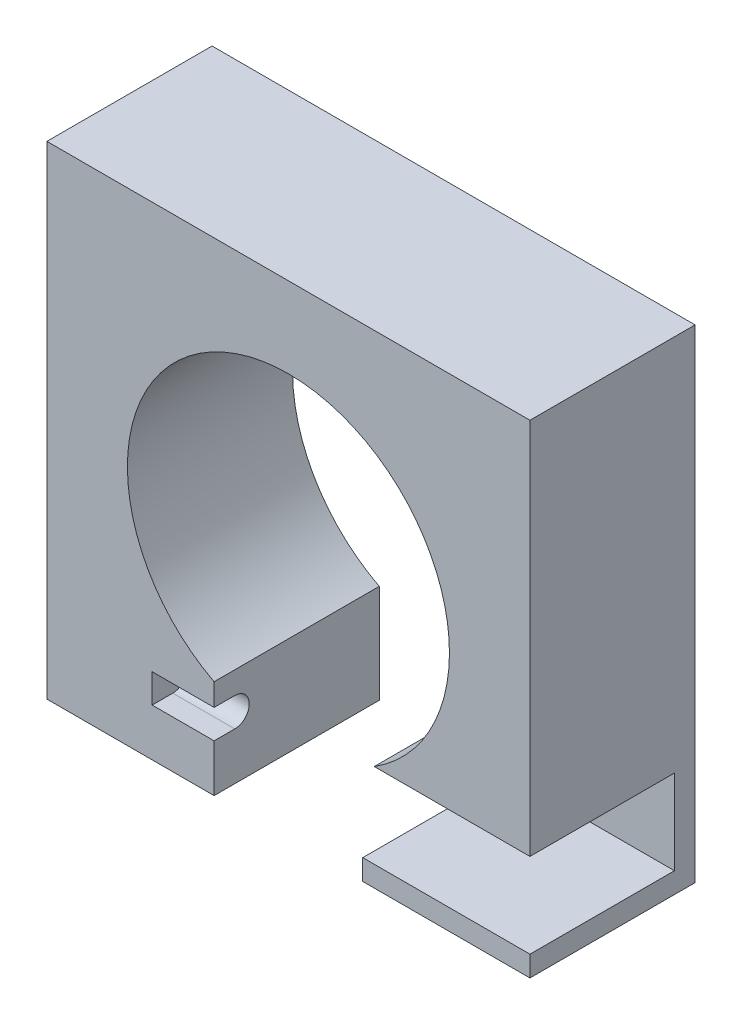
ISO-10303-21;
HEADER;
FILE_DESCRIPTION(('STEP AP214'),'2;1');
FILE_NAME('part.step','',(''),(''),'','','');
FILE_SCHEMA(('AUTOMOTIVE_DESIGN { 1 0 10303 214 1 1 1 1 }'));
ENDSEC;
DATA;
#1=APPLICATION_CONTEXT('core data for automotive mechanical design processes');
#2=APPLICATION_PROTOCOL_DEFINITION('international standard','automotive_design',2000,#1);
#3=PRODUCT_CONTEXT('',#1,'mechanical');
#4=PRODUCT('Part','Part','',(#3));
#5=PRODUCT_RELATED_PRODUCT_CATEGORY('part','',(#4));
#6=PRODUCT_DEFINITION_FORMATION('','',#4);
#7=PRODUCT_DEFINITION_CONTEXT('part definition',#1,'design');
#8=PRODUCT_DEFINITION('design','',#6,#7);
#9=PRODUCT_DEFINITION_SHAPE('','',#8);
#10=(LENGTH_UNIT() NAMED_UNIT(*) SI_UNIT(.MILLI.,.METRE.));
#11=(NAMED_UNIT(*) PLANE_ANGLE_UNIT() SI_UNIT($,.RADIAN.));
#12=(NAMED_UNIT(*) SI_UNIT($,.STERADIAN.) SOLID_ANGLE_UNIT());
#13=UNCERTAINTY_MEASURE_WITH_UNIT(LENGTH_MEASURE(1.E-05),#10,'distance_accuracy_value','');
#14=(GEOMETRIC_REPRESENTATION_CONTEXT(3) GLOBAL_UNCERTAINTY_ASSIGNED_CONTEXT((#13)) GLOBAL_UNIT_ASSIGNED_CONTEXT((#10,
#11,#12)) REPRESENTATION_CONTEXT('',''));
#15=CARTESIAN_POINT('',(0.,0.,0.));
#16=DIRECTION('',(0.,0.,1.));
#17=DIRECTION('',(1.,0.,0.));
#18=AXIS2_PLACEMENT_3D('',#15,#16,#17);
#19=CARTESIAN_POINT('',(0.,0.,40.));
#20=DIRECTION('',(0.,0.,1.));
#21=DIRECTION('',(1.,0.,0.));
#22=AXIS2_PLACEMENT_3D('',#19,#20,#21);
#23=PLANE('',#22);
#24=DIRECTION('',(-1.,0.,0.));
#25=VECTOR('',#24,1.);
#26=CARTESIAN_POINT('',(22.6488775031128,-59.4513894712058,40.));
#27=LINE('',#26,#25);
#28=CARTESIAN_POINT('',(63.1488775031128,-59.4513894712058,40.));
#29=VERTEX_POINT('',#28);
#30=CARTESIAN_POINT('',(25.4334871939393,-59.4513894712058,40.));
#31=VERTEX_POINT('',#30);
#32=EDGE_CURVE('E190',#29,#31,#27,.T.);
#33=ORIENTED_EDGE('',*,*,#32,.F.);
#34=DIRECTION('',(0.,1.,0.));
#35=VECTOR('',#34,1.);
#36=CARTESIAN_POINT('',(63.1488775031128,32.0486105287942,40.));
#37=LINE('',#36,#35);
#38=CARTESIAN_POINT('',(63.1488775031128,32.0486105287942,40.));
#39=VERTEX_POINT('',#38);
#40=EDGE_CURVE('E235',#29,#39,#37,.T.);
#41=ORIENTED_EDGE('',*,*,#40,.T.);
#42=DIRECTION('',(-1.,0.,0.));
#43=VECTOR('',#42,1.);
#44=CARTESIAN_POINT('',(-53.8511224968872,32.0486105287942,40.));
#45=LINE('',#44,#43);
#46=CARTESIAN_POINT('',(-53.8511224968872,32.0486105287942,40.));
#47=VERTEX_POINT('',#46);
#48=EDGE_CURVE('E240',#39,#47,#45,.T.);
#49=ORIENTED_EDGE('',*,*,#48,.T.);
#50=DIRECTION('',(0.,-1.,0.));
#51=VECTOR('',#50,1.);
#52=CARTESIAN_POINT('',(-53.8511224968872,32.0486105287942,40.));
#53=LINE('',#52,#51);
#54=CARTESIAN_POINT('',(-53.8511224968872,-84.9513894712058,40.));
#55=VERTEX_POINT('',#54);
#56=EDGE_CURVE('E225',#47,#55,#53,.T.);
#57=ORIENTED_EDGE('',*,*,#56,.T.);
#58=DIRECTION('',(1.,0.,0.));
#59=VECTOR('',#58,1.);
#60=CARTESIAN_POINT('',(-53.8511224968872,-84.9513894712058,40.));
#61=LINE('',#60,#59);
#62=CARTESIAN_POINT('',(-13.3511224968872,-84.9513894712058,40.));
#63=VERTEX_POINT('',#62);
#64=EDGE_CURVE('E231',#55,#63,#61,.T.);
#65=ORIENTED_EDGE('',*,*,#64,.T.);
#66=DIRECTION('',(0.,-1.,0.));
#67=VECTOR('',#66,1.);
#68=CARTESIAN_POINT('',(-13.3511224968872,32.0496105287942,40.));
#69=LINE('',#68,#67);
#70=CARTESIAN_POINT('',(-13.3511224968872,-73.4513894712058,40.));
#71=VERTEX_POINT('',#70);
#72=EDGE_CURVE('E181',#71,#63,#69,.T.);
#73=ORIENTED_EDGE('',*,*,#72,.F.);
#74=DIRECTION('',(1.,0.,0.));
#75=VECTOR('',#74,1.);
#76=CARTESIAN_POINT('',(-28.3511224968872,-73.4513894712058,40.));
#77=LINE('',#76,#75);
#78=CARTESIAN_POINT('',(-28.3511224968872,-73.4513894712058,40.));
#79=VERTEX_POINT('',#78);
#80=EDGE_CURVE('E312',#79,#71,#77,.T.);
#81=ORIENTED_EDGE('',*,*,#80,.F.);
#82=DIRECTION('',(0.,-1.,0.));
#83=VECTOR('',#82,1.);
#84=CARTESIAN_POINT('',(-28.3511224968872,0.,40.));
#85=LINE('',#84,#83);
#86=CARTESIAN_POINT('',(-28.3511224968872,-66.4513894712058,40.));
#87=VERTEX_POINT('',#86);
#88=EDGE_CURVE('E324',#87,#79,#85,.T.);
#89=ORIENTED_EDGE('',*,*,#88,.F.);
#90=DIRECTION('',(1.,0.,0.));
#91=VECTOR('',#90,1.);
#92=CARTESIAN_POINT('',(-28.3511224968872,-66.4513894712058,40.));
#93=LINE('',#92,#91);
#94=CARTESIAN_POINT('',(-13.3511224968872,-66.4513894712058,40.));
#95=VERTEX_POINT('',#94);
#96=EDGE_CURVE('E295',#87,#95,#93,.T.);
#97=ORIENTED_EDGE('',*,*,#96,.T.);
#98=CARTESIAN_POINT('',(-13.3511224968872,-61.0490772552182,40.));
#99=VERTEX_POINT('',#98);
#100=EDGE_CURVE('E185',#99,#95,#69,.T.);
#101=ORIENTED_EDGE('',*,*,#100,.F.);
#102=CARTESIAN_POINT('',(4.6488775031128,-26.4513894712058,40.));
#103=DIRECTION('',(0.,0.,1.));
#104=DIRECTION('',(1.,0.,0.));
#105=AXIS2_PLACEMENT_3D('',#102,#103,#104);
#106=CIRCLE('',#105,39.);
#107=EDGE_CURVE('E219',#31,#99,#106,.T.);
#108=ORIENTED_EDGE('',*,*,#107,.F.);
#109=EDGE_LOOP('',(#33,#41,#49,#57,#65,#73,#81,#89,#97,#101,#108));
#110=FACE_BOUND('',#109,.T.);
#111=ADVANCED_FACE('F38',(#110),#23,.T.);
#112=CARTESIAN_POINT('',(32.2988775031128,-59.4513894712058,0.));
#113=DIRECTION('',(1.,0.,0.));
#114=DIRECTION('',(0.,0.,-1.));
#115=AXIS2_PLACEMENT_3D('',#112,#113,#114);
#116=PLANE('',#115);
#117=DIRECTION('',(0.,-1.,0.));
#118=VECTOR('',#117,1.);
#119=CARTESIAN_POINT('',(32.2988775031128,-59.4513894712058,5.));
#120=LINE('',#119,#118);
#121=CARTESIAN_POINT('',(32.2988775031128,-59.4513894712058,5.));
#122=VERTEX_POINT('',#121);
#123=CARTESIAN_POINT('',(32.2988775031128,-79.9513894712058,5.));
#124=VERTEX_POINT('',#123);
#125=EDGE_CURVE('E54',#122,#124,#120,.T.);
#126=ORIENTED_EDGE('',*,*,#125,.F.);
#127=DIRECTION('',(0.,0.,1.));
#128=VECTOR('',#127,1.);
#129=CARTESIAN_POINT('',(32.2988775031128,-59.4513894712058,0.));
#130=LINE('',#129,#128);
#131=CARTESIAN_POINT('',(32.2988775031128,-59.4513894712058,0.));
#132=VERTEX_POINT('',#131);
#133=EDGE_CURVE('E171',#132,#122,#130,.T.);
#134=ORIENTED_EDGE('',*,*,#133,.F.);
#135=DIRECTION('',(0.,1.,0.));
#136=VECTOR('',#135,1.);
#137=CARTESIAN_POINT('',(32.2988775031128,-59.4513894712058,0.));
#138=LINE('',#137,#136);
#139=CARTESIAN_POINT('',(32.2988775031128,-79.9513894712058,0.));
#140=VERTEX_POINT('',#139);
#141=EDGE_CURVE('E329',#140,#132,#138,.T.);
#142=ORIENTED_EDGE('',*,*,#141,.F.);
#143=DIRECTION('',(0.,0.,1.));
#144=VECTOR('',#143,1.);
#145=CARTESIAN_POINT('',(32.2988775031128,-79.9513894712058,0.));
#146=LINE('',#145,#144);
#147=EDGE_CURVE('E173',#140,#124,#146,.T.);
#148=ORIENTED_EDGE('',*,*,#147,.T.);
#149=EDGE_LOOP('',(#126,#134,#142,#148));
#150=FACE_BOUND('',#149,.T.);
#151=ADVANCED_FACE('F169',(#150),#116,.F.);
#152=CARTESIAN_POINT('',(-53.8511224968872,-84.9513894712058,40.));
#153=DIRECTION('',(0.,1.,0.));
#154=DIRECTION('',(0.,0.,1.));
#155=AXIS2_PLACEMENT_3D('',#152,#153,#154);
#156=PLANE('',#155);
#157=CARTESIAN_POINT('',(22.6488775031128,-84.9513894712058,40.));
#158=VERTEX_POINT('',#157);
#159=CARTESIAN_POINT('',(63.1488775031128,-84.9513894712058,40.));
#160=VERTEX_POINT('',#159);
#161=EDGE_CURVE('E229',#158,#160,#61,.T.);
#162=ORIENTED_EDGE('',*,*,#161,.F.);
#163=DIRECTION('',(0.,0.,1.));
#164=VECTOR('',#163,1.);
#165=CARTESIAN_POINT('',(22.6488775031128,-84.9513894712058,40.));
#166=LINE('',#165,#164);
#167=CARTESIAN_POINT('',(22.6488775031128,-84.9513894712058,0.));
#168=VERTEX_POINT('',#167);
#169=EDGE_CURVE('E195',#168,#158,#166,.T.);
#170=ORIENTED_EDGE('',*,*,#169,.F.);
#171=DIRECTION('',(1.,0.,0.));
#172=VECTOR('',#171,1.);
#173=CARTESIAN_POINT('',(-53.8511224968872,-84.9513894712058,0.));
#174=LINE('',#173,#172);
#175=CARTESIAN_POINT('',(63.1488775031128,-84.9513894712058,0.));
#176=VERTEX_POINT('',#175);
#177=EDGE_CURVE('E247',#168,#176,#174,.T.);
#178=ORIENTED_EDGE('',*,*,#177,.T.);
#179=DIRECTION('',(0.,0.,-1.));
#180=VECTOR('',#179,1.);
#181=CARTESIAN_POINT('',(63.1488775031128,-84.9513894712058,40.));
#182=LINE('',#181,#180);
#183=EDGE_CURVE('E264',#160,#176,#182,.T.);
#184=ORIENTED_EDGE('',*,*,#183,.F.);
#185=EDGE_LOOP('',(#162,#170,#178,#184));
#186=FACE_BOUND('',#185,.T.);
#187=ADVANCED_FACE('F355',(#186),#156,.F.);
#188=CARTESIAN_POINT('',(63.1488775031128,-79.9513894712058,40.));
#189=VERTEX_POINT('',#188);
#190=EDGE_CURVE('E236',#160,#189,#37,.T.);
#191=ORIENTED_EDGE('',*,*,#190,.T.);
#192=DIRECTION('',(1.,0.,0.));
#193=VECTOR('',#192,1.);
#194=CARTESIAN_POINT('',(22.6488775031128,-79.9513894712058,40.));
#195=LINE('',#194,#193);
#196=CARTESIAN_POINT('',(22.6488775031128,-79.9513894712058,40.));
#197=VERTEX_POINT('',#196);
#198=EDGE_CURVE('E315',#197,#189,#195,.T.);
#199=ORIENTED_EDGE('',*,*,#198,.F.);
#200=DIRECTION('',(0.,-1.,0.));
#201=VECTOR('',#200,1.);
#202=CARTESIAN_POINT('',(22.6488775031128,32.0496105287942,40.));
#203=LINE('',#202,#201);
#204=EDGE_CURVE('E211',#197,#158,#203,.T.);
#205=ORIENTED_EDGE('',*,*,#204,.T.);
#206=ORIENTED_EDGE('',*,*,#161,.T.);
#207=EDGE_LOOP('',(#191,#199,#205,#206));
#208=FACE_BOUND('',#207,.T.);
#209=ADVANCED_FACE('F359',(#208),#23,.T.);
#210=CARTESIAN_POINT('',(0.,0.,0.));
#211=DIRECTION('',(0.,0.,1.));
#212=DIRECTION('',(1.,0.,0.));
#213=AXIS2_PLACEMENT_3D('',#210,#211,#212);
#214=PLANE('',#213);
#215=ORIENTED_EDGE('',*,*,#141,.T.);
#216=DIRECTION('',(-1.,0.,0.));
#217=VECTOR('',#216,1.);
#218=CARTESIAN_POINT('',(22.6488775031128,-59.4513894712058,0.));
#219=LINE('',#218,#217);
#220=CARTESIAN_POINT('',(25.4334871939393,-59.4513894712058,0.));
#221=VERTEX_POINT('',#220);
#222=EDGE_CURVE('E178',#132,#221,#219,.T.);
#223=ORIENTED_EDGE('',*,*,#222,.T.);
#224=CARTESIAN_POINT('',(4.6488775031128,-26.4513894712058,0.));
#225=DIRECTION('',(0.,0.,1.));
#226=DIRECTION('',(1.,0.,0.));
#227=AXIS2_PLACEMENT_3D('',#224,#225,#226);
#228=CIRCLE('',#227,39.);
#229=CARTESIAN_POINT('',(-13.3511224968872,-61.0490772552182,0.));
#230=VERTEX_POINT('',#229);
#231=EDGE_CURVE('E199',#221,#230,#228,.T.);
#232=ORIENTED_EDGE('',*,*,#231,.T.);
#233=DIRECTION('',(0.,-1.,0.));
#234=VECTOR('',#233,1.);
#235=CARTESIAN_POINT('',(-13.3511224968872,32.0496105287942,0.));
#236=LINE('',#235,#234);
#237=CARTESIAN_POINT('',(-13.3511224968872,-84.9513894712058,0.));
#238=VERTEX_POINT('',#237);
#239=EDGE_CURVE('E203',#230,#238,#236,.T.);
#240=ORIENTED_EDGE('',*,*,#239,.T.);
#241=CARTESIAN_POINT('',(-53.8511224968872,-84.9513894712058,0.));
#242=VERTEX_POINT('',#241);
#243=EDGE_CURVE('E248',#242,#238,#174,.T.);
#244=ORIENTED_EDGE('',*,*,#243,.F.);
#245=DIRECTION('',(0.,-1.,0.));
#246=VECTOR('',#245,1.);
#247=CARTESIAN_POINT('',(-53.8511224968872,32.0486105287942,0.));
#248=LINE('',#247,#246);
#249=CARTESIAN_POINT('',(-53.8511224968872,32.0486105287942,0.));
#250=VERTEX_POINT('',#249);
#251=EDGE_CURVE('E222',#250,#242,#248,.T.);
#252=ORIENTED_EDGE('',*,*,#251,.F.);
#253=DIRECTION('',(-1.,0.,0.));
#254=VECTOR('',#253,1.);
#255=CARTESIAN_POINT('',(-53.8511224968872,32.0486105287942,0.));
#256=LINE('',#255,#254);
#257=CARTESIAN_POINT('',(63.1488775031128,32.0486105287942,0.));
#258=VERTEX_POINT('',#257);
#259=EDGE_CURVE('E230',#258,#250,#256,.T.);
#260=ORIENTED_EDGE('',*,*,#259,.F.);
#261=DIRECTION('',(0.,1.,0.));
#262=VECTOR('',#261,1.);
#263=CARTESIAN_POINT('',(63.1488775031128,32.0486105287942,0.));
#264=LINE('',#263,#262);
#265=EDGE_CURVE('E252',#176,#258,#264,.T.);
#266=ORIENTED_EDGE('',*,*,#265,.F.);
#267=ORIENTED_EDGE('',*,*,#177,.F.);
#268=DIRECTION('',(0.,-1.,0.));
#269=VECTOR('',#268,1.);
#270=CARTESIAN_POINT('',(22.6488775031128,32.0496105287942,0.));
#271=LINE('',#270,#269);
#272=CARTESIAN_POINT('',(22.6488775031128,-79.9513894712058,0.));
#273=VERTEX_POINT('',#272);
#274=EDGE_CURVE('E207',#273,#168,#271,.T.);
#275=ORIENTED_EDGE('',*,*,#274,.F.);
#276=DIRECTION('',(1.,0.,0.));
#277=VECTOR('',#276,1.);
#278=CARTESIAN_POINT('',(22.6488775031128,-79.9513894712058,0.));
#279=LINE('',#278,#277);
#280=EDGE_CURVE('E325',#273,#140,#279,.T.);
#281=ORIENTED_EDGE('',*,*,#280,.T.);
#282=EDGE_LOOP('',(#215,#223,#232,#240,#244,#252,#260,#266,#267,#275,#281));
#283=FACE_BOUND('',#282,.T.);
#284=ADVANCED_FACE('F279',(#283),#214,.F.);
#285=CARTESIAN_POINT('',(-53.8511224968872,32.0486105287942,40.));
#286=DIRECTION('',(1.,0.,0.));
#287=DIRECTION('',(0.,0.,-1.));
#288=AXIS2_PLACEMENT_3D('',#285,#286,#287);
#289=PLANE('',#288);
#290=ORIENTED_EDGE('',*,*,#251,.T.);
#291=DIRECTION('',(0.,0.,-1.));
#292=VECTOR('',#291,1.);
#293=CARTESIAN_POINT('',(-53.8511224968872,-84.9513894712058,40.));
#294=LINE('',#293,#292);
#295=EDGE_CURVE('E47',#55,#242,#294,.T.);
#296=ORIENTED_EDGE('',*,*,#295,.F.);
#297=ORIENTED_EDGE('',*,*,#56,.F.);
#298=DIRECTION('',(0.,0.,-1.));
#299=VECTOR('',#298,1.);
#300=CARTESIAN_POINT('',(-53.8511224968872,32.0486105287942,40.));
#301=LINE('',#300,#299);
#302=EDGE_CURVE('E243',#47,#250,#301,.T.);
#303=ORIENTED_EDGE('',*,*,#302,.T.);
#304=EDGE_LOOP('',(#290,#296,#297,#303));
#305=FACE_BOUND('',#304,.T.);
#306=ADVANCED_FACE('F40',(#305),#289,.F.);
#307=ORIENTED_EDGE('',*,*,#243,.T.);
#308=DIRECTION('',(0.,0.,-1.));
#309=VECTOR('',#308,1.);
#310=CARTESIAN_POINT('',(-13.3511224968872,-84.9513894712058,40.));
#311=LINE('',#310,#309);
#312=EDGE_CURVE('E200',#63,#238,#311,.T.);
#313=ORIENTED_EDGE('',*,*,#312,.F.);
#314=ORIENTED_EDGE('',*,*,#64,.F.);
#315=ORIENTED_EDGE('',*,*,#295,.T.);
#316=EDGE_LOOP('',(#307,#313,#314,#315));
#317=FACE_BOUND('',#316,.T.);
#318=ADVANCED_FACE('F271',(#317),#156,.F.);
#319=CARTESIAN_POINT('',(63.1488775031128,32.0486105287942,40.));
#320=DIRECTION('',(-1.,0.,0.));
#321=DIRECTION('',(0.,-1.,0.));
#322=AXIS2_PLACEMENT_3D('',#319,#320,#321);
#323=PLANE('',#322);
#324=ORIENTED_EDGE('',*,*,#40,.F.);
#325=DIRECTION('',(0.,0.,-1.));
#326=VECTOR('',#325,1.);
#327=CARTESIAN_POINT('',(63.1488775031128,-59.4513894712058,40.));
#328=LINE('',#327,#326);
#329=CARTESIAN_POINT('',(63.1488775031128,-59.4513894712058,5.));
#330=VERTEX_POINT('',#329);
#331=EDGE_CURVE('E338',#29,#330,#328,.T.);
#332=ORIENTED_EDGE('',*,*,#331,.T.);
#333=DIRECTION('',(0.,1.,0.));
#334=VECTOR('',#333,1.);
#335=CARTESIAN_POINT('',(63.1488775031128,32.0486105287942,5.));
#336=LINE('',#335,#334);
#337=CARTESIAN_POINT('',(63.1488775031128,-79.9513894712058,5.));
#338=VERTEX_POINT('',#337);
#339=EDGE_CURVE('E159',#338,#330,#336,.T.);
#340=ORIENTED_EDGE('',*,*,#339,.F.);
#341=DIRECTION('',(0.,0.,1.));
#342=VECTOR('',#341,1.);
#343=CARTESIAN_POINT('',(63.1488775031128,-79.9513894712058,40.));
#344=LINE('',#343,#342);
#345=EDGE_CURVE('E342',#338,#189,#344,.T.);
#346=ORIENTED_EDGE('',*,*,#345,.T.);
#347=ORIENTED_EDGE('',*,*,#190,.F.);
#348=ORIENTED_EDGE('',*,*,#183,.T.);
#349=ORIENTED_EDGE('',*,*,#265,.T.);
#350=DIRECTION('',(0.,0.,-1.));
#351=VECTOR('',#350,1.);
#352=CARTESIAN_POINT('',(63.1488775031128,32.0486105287942,40.));
#353=LINE('',#352,#351);
#354=EDGE_CURVE('E260',#39,#258,#353,.T.);
#355=ORIENTED_EDGE('',*,*,#354,.F.);
#356=EDGE_LOOP('',(#324,#332,#340,#346,#347,#348,#349,#355));
#357=FACE_BOUND('',#356,.T.);
#358=ADVANCED_FACE('F345',(#357),#323,.F.);
#359=CARTESIAN_POINT('',(-53.8511224968872,32.0486105287942,40.));
#360=DIRECTION('',(0.,-1.,0.));
#361=DIRECTION('',(0.,0.,-1.));
#362=AXIS2_PLACEMENT_3D('',#359,#360,#361);
#363=PLANE('',#362);
#364=ORIENTED_EDGE('',*,*,#259,.T.);
#365=ORIENTED_EDGE('',*,*,#302,.F.);
#366=ORIENTED_EDGE('',*,*,#48,.F.);
#367=ORIENTED_EDGE('',*,*,#354,.T.);
#368=EDGE_LOOP('',(#364,#365,#366,#367));
#369=FACE_BOUND('',#368,.T.);
#370=ADVANCED_FACE('F388',(#369),#363,.F.);
#371=CARTESIAN_POINT('',(4.6488775031128,-26.4513894712058,40.));
#372=DIRECTION('',(0.,0.,-1.));
#373=DIRECTION('',(-1.,0.,0.));
#374=AXIS2_PLACEMENT_3D('',#371,#372,#373);
#375=CYLINDRICAL_SURFACE('',#374,39.);
#376=DIRECTION('',(0.,0.,-1.));
#377=VECTOR('',#376,1.);
#378=CARTESIAN_POINT('',(25.4334871939393,-59.4513894712058,40.));
#379=LINE('',#378,#377);
#380=EDGE_CURVE('E11',#31,#221,#379,.T.);
#381=ORIENTED_EDGE('',*,*,#380,.F.);
#382=ORIENTED_EDGE('',*,*,#107,.T.);
#383=DIRECTION('',(0.,0.,-1.));
#384=VECTOR('',#383,1.);
#385=CARTESIAN_POINT('',(-13.3511224968872,-61.0490772552182,40.));
#386=LINE('',#385,#384);
#387=EDGE_CURVE('E204',#99,#230,#386,.T.);
#388=ORIENTED_EDGE('',*,*,#387,.T.);
#389=ORIENTED_EDGE('',*,*,#231,.F.);
#390=EDGE_LOOP('',(#381,#382,#388,#389));
#391=FACE_BOUND('',#390,.T.);
#392=ADVANCED_FACE('F290',(#391),#375,.F.);
#393=CARTESIAN_POINT('',(-13.3511224968872,32.0496105287942,40.));
#394=DIRECTION('',(-1.,0.,0.));
#395=DIRECTION('',(0.,0.,1.));
#396=AXIS2_PLACEMENT_3D('',#393,#394,#395);
#397=PLANE('',#396);
#398=CARTESIAN_POINT('',(-13.3511224968872,-69.9513894712058,35.));
#399=DIRECTION('',(1.,0.,0.));
#400=DIRECTION('',(0.,0.,-1.));
#401=AXIS2_PLACEMENT_3D('',#398,#399,#400);
#402=CIRCLE('',#401,3.5);
#403=CARTESIAN_POINT('',(-13.3511224968872,-73.4513894712058,35.));
#404=VERTEX_POINT('',#403);
#405=CARTESIAN_POINT('',(-13.3511224968872,-66.4513894712058,35.));
#406=VERTEX_POINT('',#405);
#407=EDGE_CURVE('E299',#404,#406,#402,.T.);
#408=ORIENTED_EDGE('',*,*,#407,.F.);
#409=DIRECTION('',(0.,0.,-1.));
#410=VECTOR('',#409,1.);
#411=CARTESIAN_POINT('',(-13.3511224968872,-73.4513894712058,0.));
#412=LINE('',#411,#410);
#413=EDGE_CURVE('E62',#71,#404,#412,.T.);
#414=ORIENTED_EDGE('',*,*,#413,.F.);
#415=ORIENTED_EDGE('',*,*,#72,.T.);
#416=ORIENTED_EDGE('',*,*,#312,.T.);
#417=ORIENTED_EDGE('',*,*,#239,.F.);
#418=ORIENTED_EDGE('',*,*,#387,.F.);
#419=ORIENTED_EDGE('',*,*,#100,.T.);
#420=DIRECTION('',(0.,0.,-1.));
#421=VECTOR('',#420,1.);
#422=CARTESIAN_POINT('',(-13.3511224968872,-66.4513894712058,0.));
#423=LINE('',#422,#421);
#424=EDGE_CURVE('E297',#95,#406,#423,.T.);
#425=ORIENTED_EDGE('',*,*,#424,.T.);
#426=EDGE_LOOP('',(#408,#414,#415,#416,#417,#418,#419,#425));
#427=FACE_BOUND('',#426,.T.);
#428=ADVANCED_FACE('F286',(#427),#397,.F.);
#429=CARTESIAN_POINT('',(22.6488775031128,32.0496105287942,40.));
#430=DIRECTION('',(1.,0.,0.));
#431=DIRECTION('',(0.,0.,-1.));
#432=AXIS2_PLACEMENT_3D('',#429,#430,#431);
#433=PLANE('',#432);
#434=ORIENTED_EDGE('',*,*,#204,.F.);
#435=DIRECTION('',(0.,0.,1.));
#436=VECTOR('',#435,1.);
#437=CARTESIAN_POINT('',(22.6488775031128,-79.9513894712058,0.));
#438=LINE('',#437,#436);
#439=EDGE_CURVE('E187',#273,#197,#438,.T.);
#440=ORIENTED_EDGE('',*,*,#439,.F.);
#441=ORIENTED_EDGE('',*,*,#274,.T.);
#442=ORIENTED_EDGE('',*,*,#169,.T.);
#443=EDGE_LOOP('',(#434,#440,#441,#442));
#444=FACE_BOUND('',#443,.T.);
#445=ADVANCED_FACE('F363',(#444),#433,.F.);
#446=CARTESIAN_POINT('',(22.6488775031128,-59.4513894712058,0.));
#447=DIRECTION('',(0.,1.,0.));
#448=DIRECTION('',(0.,0.,1.));
#449=AXIS2_PLACEMENT_3D('',#446,#447,#448);
#450=PLANE('',#449);
#451=ORIENTED_EDGE('',*,*,#380,.T.);
#452=ORIENTED_EDGE('',*,*,#222,.F.);
#453=ORIENTED_EDGE('',*,*,#133,.T.);
#454=DIRECTION('',(-1.,0.,0.));
#455=VECTOR('',#454,1.);
#456=CARTESIAN_POINT('',(32.2988775031128,-59.4513894712058,5.));
#457=LINE('',#456,#455);
#458=EDGE_CURVE('E156',#330,#122,#457,.T.);
#459=ORIENTED_EDGE('',*,*,#458,.F.);
#460=ORIENTED_EDGE('',*,*,#331,.F.);
#461=ORIENTED_EDGE('',*,*,#32,.T.);
#462=EDGE_LOOP('',(#451,#452,#453,#459,#460,#461));
#463=FACE_BOUND('',#462,.T.);
#464=ADVANCED_FACE('F176',(#463),#450,.F.);
#465=CARTESIAN_POINT('',(22.6488775031128,-79.9513894712058,0.));
#466=DIRECTION('',(0.,-1.,0.));
#467=DIRECTION('',(0.,0.,-1.));
#468=AXIS2_PLACEMENT_3D('',#465,#466,#467);
#469=PLANE('',#468);
#470=ORIENTED_EDGE('',*,*,#198,.T.);
#471=ORIENTED_EDGE('',*,*,#345,.F.);
#472=DIRECTION('',(1.,0.,0.));
#473=VECTOR('',#472,1.);
#474=CARTESIAN_POINT('',(32.2988775031128,-79.9513894712058,5.));
#475=LINE('',#474,#473);
#476=EDGE_CURVE('E165',#124,#338,#475,.T.);
#477=ORIENTED_EDGE('',*,*,#476,.F.);
#478=ORIENTED_EDGE('',*,*,#147,.F.);
#479=ORIENTED_EDGE('',*,*,#280,.F.);
#480=ORIENTED_EDGE('',*,*,#439,.T.);
#481=EDGE_LOOP('',(#470,#471,#477,#478,#479,#480));
#482=FACE_BOUND('',#481,.T.);
#483=ADVANCED_FACE('F364',(#482),#469,.F.);
#484=CARTESIAN_POINT('',(-28.3511224968872,-73.4513894712058,0.));
#485=DIRECTION('',(0.,-1.,0.));
#486=DIRECTION('',(0.,0.,-1.));
#487=AXIS2_PLACEMENT_3D('',#484,#485,#486);
#488=PLANE('',#487);
#489=ORIENTED_EDGE('',*,*,#413,.T.);
#490=DIRECTION('',(1.,0.,0.));
#491=VECTOR('',#490,1.);
#492=CARTESIAN_POINT('',(-28.3511224968872,-73.4513894712058,35.));
#493=LINE('',#492,#491);
#494=CARTESIAN_POINT('',(-28.3511224968872,-73.4513894712058,35.));
#495=VERTEX_POINT('',#494);
#496=EDGE_CURVE('E321',#495,#404,#493,.T.);
#497=ORIENTED_EDGE('',*,*,#496,.F.);
#498=DIRECTION('',(0.,0.,-1.));
#499=VECTOR('',#498,1.);
#500=CARTESIAN_POINT('',(-28.3511224968872,-73.4513894712058,0.));
#501=LINE('',#500,#499);
#502=EDGE_CURVE('E302',#79,#495,#501,.T.);
#503=ORIENTED_EDGE('',*,*,#502,.F.);
#504=ORIENTED_EDGE('',*,*,#80,.T.);
#505=EDGE_LOOP('',(#489,#497,#503,#504));
#506=FACE_BOUND('',#505,.T.);
#507=ADVANCED_FACE('F386',(#506),#488,.F.);
#508=CARTESIAN_POINT('',(-28.3511224968872,-66.4513894712058,0.));
#509=DIRECTION('',(0.,-1.,0.));
#510=DIRECTION('',(0.,0.,-1.));
#511=AXIS2_PLACEMENT_3D('',#508,#509,#510);
#512=PLANE('',#511);
#513=ORIENTED_EDGE('',*,*,#424,.F.);
#514=ORIENTED_EDGE('',*,*,#96,.F.);
#515=DIRECTION('',(0.,0.,-1.));
#516=VECTOR('',#515,1.);
#517=CARTESIAN_POINT('',(-28.3511224968872,-66.4513894712058,0.));
#518=LINE('',#517,#516);
#519=CARTESIAN_POINT('',(-28.3511224968872,-66.4513894712058,35.));
#520=VERTEX_POINT('',#519);
#521=EDGE_CURVE('E375',#87,#520,#518,.T.);
#522=ORIENTED_EDGE('',*,*,#521,.T.);
#523=DIRECTION('',(1.,0.,0.));
#524=VECTOR('',#523,1.);
#525=CARTESIAN_POINT('',(-28.3511224968872,-66.4513894712058,35.));
#526=LINE('',#525,#524);
#527=EDGE_CURVE('E318',#520,#406,#526,.T.);
#528=ORIENTED_EDGE('',*,*,#527,.T.);
#529=EDGE_LOOP('',(#513,#514,#522,#528));
#530=FACE_BOUND('',#529,.T.);
#531=ADVANCED_FACE('F459',(#530),#512,.T.);
#532=CARTESIAN_POINT('',(-28.3511224968872,-69.9513894712058,35.));
#533=DIRECTION('',(1.,0.,0.));
#534=DIRECTION('',(0.,0.,-1.));
#535=AXIS2_PLACEMENT_3D('',#532,#533,#534);
#536=CYLINDRICAL_SURFACE('',#535,3.5);
#537=ORIENTED_EDGE('',*,*,#407,.T.);
#538=ORIENTED_EDGE('',*,*,#527,.F.);
#539=CARTESIAN_POINT('',(-28.3511224968872,-69.9513894712058,35.));
#540=DIRECTION('',(1.,0.,0.));
#541=DIRECTION('',(0.,0.,-1.));
#542=AXIS2_PLACEMENT_3D('',#539,#540,#541);
#543=CIRCLE('',#542,3.5);
#544=EDGE_CURVE('E307',#495,#520,#543,.T.);
#545=ORIENTED_EDGE('',*,*,#544,.F.);
#546=ORIENTED_EDGE('',*,*,#496,.T.);
#547=EDGE_LOOP('',(#537,#538,#545,#546));
#548=FACE_BOUND('',#547,.T.);
#549=ADVANCED_FACE('F470',(#548),#536,.F.);
#550=CARTESIAN_POINT('',(-28.3511224968872,0.,0.));
#551=DIRECTION('',(1.,0.,0.));
#552=DIRECTION('',(0.,0.,-1.));
#553=AXIS2_PLACEMENT_3D('',#550,#551,#552);
#554=PLANE('',#553);
#555=ORIENTED_EDGE('',*,*,#502,.T.);
#556=ORIENTED_EDGE('',*,*,#544,.T.);
#557=ORIENTED_EDGE('',*,*,#521,.F.);
#558=ORIENTED_EDGE('',*,*,#88,.T.);
#559=EDGE_LOOP('',(#555,#556,#557,#558));
#560=FACE_BOUND('',#559,.T.);
#561=ADVANCED_FACE('F384',(#560),#554,.T.);
#562=CARTESIAN_POINT('',(0.,0.,5.));
#563=DIRECTION('',(0.,0.,1.));
#564=DIRECTION('',(1.,0.,0.));
#565=AXIS2_PLACEMENT_3D('',#562,#563,#564);
#566=PLANE('',#565);
#567=ORIENTED_EDGE('',*,*,#339,.T.);
#568=ORIENTED_EDGE('',*,*,#458,.T.);
#569=ORIENTED_EDGE('',*,*,#125,.T.);
#570=ORIENTED_EDGE('',*,*,#476,.T.);
#571=EDGE_LOOP('',(#567,#568,#569,#570));
#572=FACE_BOUND('',#571,.T.);
#573=ADVANCED_FACE('F157',(#572),#566,.T.);
#574=CLOSED_SHELL('',(#111,#151,#187,#209,#284,#306,#318,#358,#370,#392,#428,#445,#464,#483,
#507,#531,#549,#561,#573));
#575=MANIFOLD_SOLID_BREP('B2',#574);
#576=ADVANCED_BREP_SHAPE_REPRESENTATION('',(#18,#575),#14);
#577=SHAPE_DEFINITION_REPRESENTATION(#9,#576);
ENDSEC;
END-ISO-10303-21;
